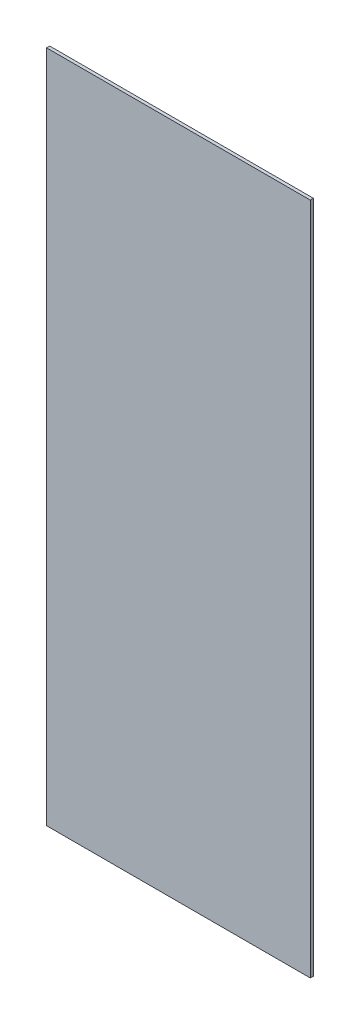
ISO-10303-21;
HEADER;
FILE_DESCRIPTION(('STEP AP214'),'2;1');
FILE_NAME('part.step','',(''),(''),'','','');
FILE_SCHEMA(('AUTOMOTIVE_DESIGN { 1 0 10303 214 1 1 1 1 }'));
ENDSEC;
DATA;
#1=APPLICATION_CONTEXT('core data for automotive mechanical design processes');
#2=APPLICATION_PROTOCOL_DEFINITION('international standard','automotive_design',2000,#1);
#3=PRODUCT_CONTEXT('',#1,'mechanical');
#4=PRODUCT('Part','Part','',(#3));
#5=PRODUCT_RELATED_PRODUCT_CATEGORY('part','',(#4));
#6=PRODUCT_DEFINITION_FORMATION('','',#4);
#7=PRODUCT_DEFINITION_CONTEXT('part definition',#1,'design');
#8=PRODUCT_DEFINITION('design','',#6,#7);
#9=PRODUCT_DEFINITION_SHAPE('','',#8);
#10=(LENGTH_UNIT() NAMED_UNIT(*) SI_UNIT(.MILLI.,.METRE.));
#11=(NAMED_UNIT(*) PLANE_ANGLE_UNIT() SI_UNIT($,.RADIAN.));
#12=(NAMED_UNIT(*) SI_UNIT($,.STERADIAN.) SOLID_ANGLE_UNIT());
#13=UNCERTAINTY_MEASURE_WITH_UNIT(LENGTH_MEASURE(1.E-05),#10,'distance_accuracy_value','');
#14=(GEOMETRIC_REPRESENTATION_CONTEXT(3) GLOBAL_UNCERTAINTY_ASSIGNED_CONTEXT((#13)) GLOBAL_UNIT_ASSIGNED_CONTEXT((#10,
#11,#12)) REPRESENTATION_CONTEXT('',''));
#15=CARTESIAN_POINT('',(0.,0.,0.));
#16=DIRECTION('',(0.,0.,1.));
#17=DIRECTION('',(1.,0.,0.));
#18=AXIS2_PLACEMENT_3D('',#15,#16,#17);
#19=CARTESIAN_POINT('',(126.25,322.5,3.));
#20=DIRECTION('',(-1.,0.,0.));
#21=DIRECTION('',(0.,0.,1.));
#22=AXIS2_PLACEMENT_3D('',#19,#20,#21);
#23=PLANE('',#22);
#24=DIRECTION('',(0.,1.,0.));
#25=VECTOR('',#24,1.);
#26=CARTESIAN_POINT('',(126.25,322.5,0.));
#27=LINE('',#26,#25);
#28=CARTESIAN_POINT('',(126.25,-322.5,0.));
#29=VERTEX_POINT('',#28);
#30=CARTESIAN_POINT('',(126.25,322.5,0.));
#31=VERTEX_POINT('',#30);
#32=EDGE_CURVE('E96',#29,#31,#27,.T.);
#33=ORIENTED_EDGE('',*,*,#32,.T.);
#34=DIRECTION('',(0.,0.,-1.));
#35=VECTOR('',#34,1.);
#36=CARTESIAN_POINT('',(126.25,322.5,3.));
#37=LINE('',#36,#35);
#38=CARTESIAN_POINT('',(126.25,322.5,3.));
#39=VERTEX_POINT('',#38);
#40=EDGE_CURVE('E11',#39,#31,#37,.T.);
#41=ORIENTED_EDGE('',*,*,#40,.F.);
#42=DIRECTION('',(0.,1.,0.));
#43=VECTOR('',#42,1.);
#44=CARTESIAN_POINT('',(126.25,322.5,3.));
#45=LINE('',#44,#43);
#46=CARTESIAN_POINT('',(126.25,-322.5,3.));
#47=VERTEX_POINT('',#46);
#48=EDGE_CURVE('E84',#47,#39,#45,.T.);
#49=ORIENTED_EDGE('',*,*,#48,.F.);
#50=DIRECTION('',(0.,0.,-1.));
#51=VECTOR('',#50,1.);
#52=CARTESIAN_POINT('',(126.25,-322.5,3.));
#53=LINE('',#52,#51);
#54=EDGE_CURVE('E92',#47,#29,#53,.T.);
#55=ORIENTED_EDGE('',*,*,#54,.T.);
#56=EDGE_LOOP('',(#33,#41,#49,#55));
#57=FACE_BOUND('',#56,.T.);
#58=ADVANCED_FACE('F33',(#57),#23,.F.);
#59=CARTESIAN_POINT('',(-126.25,322.5,3.));
#60=DIRECTION('',(0.,-1.,0.));
#61=DIRECTION('',(0.,0.,-1.));
#62=AXIS2_PLACEMENT_3D('',#59,#60,#61);
#63=PLANE('',#62);
#64=DIRECTION('',(-1.,0.,0.));
#65=VECTOR('',#64,1.);
#66=CARTESIAN_POINT('',(-126.25,322.5,0.));
#67=LINE('',#66,#65);
#68=CARTESIAN_POINT('',(-126.25,322.5,0.));
#69=VERTEX_POINT('',#68);
#70=EDGE_CURVE('E88',#31,#69,#67,.T.);
#71=ORIENTED_EDGE('',*,*,#70,.T.);
#72=DIRECTION('',(0.,0.,-1.));
#73=VECTOR('',#72,1.);
#74=CARTESIAN_POINT('',(-126.25,322.5,3.));
#75=LINE('',#74,#73);
#76=CARTESIAN_POINT('',(-126.25,322.5,3.));
#77=VERTEX_POINT('',#76);
#78=EDGE_CURVE('E41',#77,#69,#75,.T.);
#79=ORIENTED_EDGE('',*,*,#78,.F.);
#80=DIRECTION('',(-1.,0.,0.));
#81=VECTOR('',#80,1.);
#82=CARTESIAN_POINT('',(-126.25,322.5,3.));
#83=LINE('',#82,#81);
#84=EDGE_CURVE('E79',#39,#77,#83,.T.);
#85=ORIENTED_EDGE('',*,*,#84,.F.);
#86=ORIENTED_EDGE('',*,*,#40,.T.);
#87=EDGE_LOOP('',(#71,#79,#85,#86));
#88=FACE_BOUND('',#87,.T.);
#89=ADVANCED_FACE('F87',(#88),#63,.F.);
#90=CARTESIAN_POINT('',(-126.25,322.5,3.));
#91=DIRECTION('',(1.,0.,0.));
#92=DIRECTION('',(0.,1.,0.));
#93=AXIS2_PLACEMENT_3D('',#90,#91,#92);
#94=PLANE('',#93);
#95=DIRECTION('',(0.,-1.,0.));
#96=VECTOR('',#95,1.);
#97=CARTESIAN_POINT('',(-126.25,322.5,0.));
#98=LINE('',#97,#96);
#99=CARTESIAN_POINT('',(-126.25,-322.5,0.));
#100=VERTEX_POINT('',#99);
#101=EDGE_CURVE('E66',#69,#100,#98,.T.);
#102=ORIENTED_EDGE('',*,*,#101,.T.);
#103=DIRECTION('',(0.,0.,-1.));
#104=VECTOR('',#103,1.);
#105=CARTESIAN_POINT('',(-126.25,-322.5,3.));
#106=LINE('',#105,#104);
#107=CARTESIAN_POINT('',(-126.25,-322.5,3.));
#108=VERTEX_POINT('',#107);
#109=EDGE_CURVE('E89',#108,#100,#106,.T.);
#110=ORIENTED_EDGE('',*,*,#109,.F.);
#111=DIRECTION('',(0.,-1.,0.));
#112=VECTOR('',#111,1.);
#113=CARTESIAN_POINT('',(-126.25,322.5,3.));
#114=LINE('',#113,#112);
#115=EDGE_CURVE('E82',#77,#108,#114,.T.);
#116=ORIENTED_EDGE('',*,*,#115,.F.);
#117=ORIENTED_EDGE('',*,*,#78,.T.);
#118=EDGE_LOOP('',(#102,#110,#116,#117));
#119=FACE_BOUND('',#118,.T.);
#120=ADVANCED_FACE('F90',(#119),#94,.F.);
#121=CARTESIAN_POINT('',(-126.25,-322.5,3.));
#122=DIRECTION('',(0.,1.,0.));
#123=DIRECTION('',(0.,0.,1.));
#124=AXIS2_PLACEMENT_3D('',#121,#122,#123);
#125=PLANE('',#124);
#126=DIRECTION('',(1.,0.,0.));
#127=VECTOR('',#126,1.);
#128=CARTESIAN_POINT('',(-126.25,-322.5,0.));
#129=LINE('',#128,#127);
#130=EDGE_CURVE('E72',#100,#29,#129,.T.);
#131=ORIENTED_EDGE('',*,*,#130,.T.);
#132=ORIENTED_EDGE('',*,*,#54,.F.);
#133=DIRECTION('',(1.,0.,0.));
#134=VECTOR('',#133,1.);
#135=CARTESIAN_POINT('',(-126.25,-322.5,3.));
#136=LINE('',#135,#134);
#137=EDGE_CURVE('E49',#108,#47,#136,.T.);
#138=ORIENTED_EDGE('',*,*,#137,.F.);
#139=ORIENTED_EDGE('',*,*,#109,.T.);
#140=EDGE_LOOP('',(#131,#132,#138,#139));
#141=FACE_BOUND('',#140,.T.);
#142=ADVANCED_FACE('F103',(#141),#125,.F.);
#143=CARTESIAN_POINT('',(0.,0.,3.));
#144=DIRECTION('',(0.,0.,1.));
#145=DIRECTION('',(1.,0.,0.));
#146=AXIS2_PLACEMENT_3D('',#143,#144,#145);
#147=PLANE('',#146);
#148=ORIENTED_EDGE('',*,*,#48,.T.);
#149=ORIENTED_EDGE('',*,*,#84,.T.);
#150=ORIENTED_EDGE('',*,*,#115,.T.);
#151=ORIENTED_EDGE('',*,*,#137,.T.);
#152=EDGE_LOOP('',(#148,#149,#150,#151));
#153=FACE_BOUND('',#152,.T.);
#154=ADVANCED_FACE('F80',(#153),#147,.T.);
#155=CARTESIAN_POINT('',(0.,0.,0.));
#156=DIRECTION('',(0.,0.,1.));
#157=DIRECTION('',(1.,0.,0.));
#158=AXIS2_PLACEMENT_3D('',#155,#156,#157);
#159=PLANE('',#158);
#160=ORIENTED_EDGE('',*,*,#32,.F.);
#161=ORIENTED_EDGE('',*,*,#130,.F.);
#162=ORIENTED_EDGE('',*,*,#101,.F.);
#163=ORIENTED_EDGE('',*,*,#70,.F.);
#164=EDGE_LOOP('',(#160,#161,#162,#163));
#165=FACE_BOUND('',#164,.T.);
#166=ADVANCED_FACE('F106',(#165),#159,.F.);
#167=CLOSED_SHELL('',(#58,#89,#120,#142,#154,#166));
#168=MANIFOLD_SOLID_BREP('B2',#167);
#169=ADVANCED_BREP_SHAPE_REPRESENTATION('',(#18,#168),#14);
#170=SHAPE_DEFINITION_REPRESENTATION(#9,#169);
ENDSEC;
END-ISO-10303-21;
